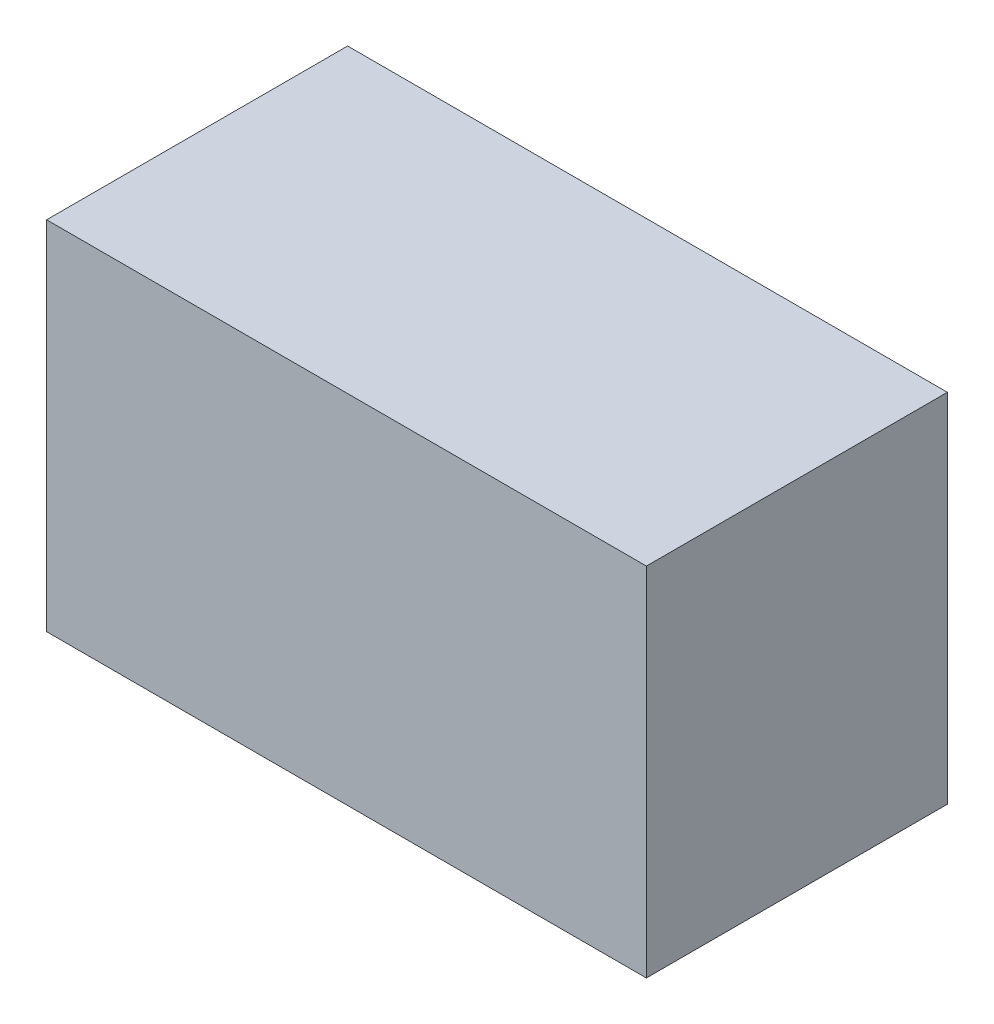
ISO-10303-21;
HEADER;
FILE_DESCRIPTION(('STEP AP214'),'2;1');
FILE_NAME('part.step','',(''),(''),'','','');
FILE_SCHEMA(('AUTOMOTIVE_DESIGN { 1 0 10303 214 1 1 1 1 }'));
ENDSEC;
DATA;
#1=APPLICATION_CONTEXT('core data for automotive mechanical design processes');
#2=APPLICATION_PROTOCOL_DEFINITION('international standard','automotive_design',2000,#1);
#3=PRODUCT_CONTEXT('',#1,'mechanical');
#4=PRODUCT('Part','Part','',(#3));
#5=PRODUCT_RELATED_PRODUCT_CATEGORY('part','',(#4));
#6=PRODUCT_DEFINITION_FORMATION('','',#4);
#7=PRODUCT_DEFINITION_CONTEXT('part definition',#1,'design');
#8=PRODUCT_DEFINITION('design','',#6,#7);
#9=PRODUCT_DEFINITION_SHAPE('','',#8);
#10=(LENGTH_UNIT() NAMED_UNIT(*) SI_UNIT(.MILLI.,.METRE.));
#11=(NAMED_UNIT(*) PLANE_ANGLE_UNIT() SI_UNIT($,.RADIAN.));
#12=(NAMED_UNIT(*) SI_UNIT($,.STERADIAN.) SOLID_ANGLE_UNIT());
#13=UNCERTAINTY_MEASURE_WITH_UNIT(LENGTH_MEASURE(1.E-05),#10,'distance_accuracy_value','');
#14=(GEOMETRIC_REPRESENTATION_CONTEXT(3) GLOBAL_UNCERTAINTY_ASSIGNED_CONTEXT((#13)) GLOBAL_UNIT_ASSIGNED_CONTEXT((#10,
#11,#12)) REPRESENTATION_CONTEXT('',''));
#15=CARTESIAN_POINT('',(0.,0.,0.));
#16=DIRECTION('',(0.,0.,1.));
#17=DIRECTION('',(1.,0.,0.));
#18=AXIS2_PLACEMENT_3D('',#15,#16,#17);
#19=CARTESIAN_POINT('',(-1.34500336123163,0.80001339826083,0.));
#20=DIRECTION('',(-1.,4.37113882867379E-08,0.));
#21=DIRECTION('',(-4.37113882867379E-08,-1.,0.));
#22=AXIS2_PLACEMENT_3D('',#19,#20,#21);
#23=PLANE('',#22);
#24=DIRECTION('',(-4.37113883242782E-08,-0.999999999999999,0.));
#25=VECTOR('',#24,1.);
#26=CARTESIAN_POINT('',(-1.34500336123163,0.80001339826083,0.));
#27=LINE('',#26,#25);
#28=CARTESIAN_POINT('',(-1.34500336123163,0.80001339826083,0.));
#29=VERTEX_POINT('',#28);
#30=CARTESIAN_POINT('',(-1.34500343117013,-0.799992705254795,0.));
#31=VERTEX_POINT('',#30);
#32=EDGE_CURVE('E11',#29,#31,#27,.T.);
#33=ORIENTED_EDGE('',*,*,#32,.T.);
#34=DIRECTION('',(0.,0.,1.));
#35=VECTOR('',#34,1.);
#36=CARTESIAN_POINT('',(-1.34500343117012,-0.799992705254795,0.));
#37=LINE('',#36,#35);
#38=CARTESIAN_POINT('',(-1.34500343117013,-0.799992705254795,1.34999978542328));
#39=VERTEX_POINT('',#38);
#40=EDGE_CURVE('E88',#31,#39,#37,.T.);
#41=ORIENTED_EDGE('',*,*,#40,.T.);
#42=DIRECTION('',(-4.37113883242782E-08,-0.999999999999999,0.));
#43=VECTOR('',#42,1.);
#44=CARTESIAN_POINT('',(-1.34500336123163,0.80001339826083,1.34999978542328));
#45=LINE('',#44,#43);
#46=CARTESIAN_POINT('',(-1.34500336123163,0.80001339826083,1.34999978542328));
#47=VERTEX_POINT('',#46);
#48=EDGE_CURVE('E83',#47,#39,#45,.T.);
#49=ORIENTED_EDGE('',*,*,#48,.F.);
#50=DIRECTION('',(0.,0.,1.));
#51=VECTOR('',#50,1.);
#52=CARTESIAN_POINT('',(-1.34500336123163,0.800013398260833,0.));
#53=LINE('',#52,#51);
#54=EDGE_CURVE('E72',#29,#47,#53,.T.);
#55=ORIENTED_EDGE('',*,*,#54,.F.);
#56=EDGE_LOOP('',(#33,#41,#49,#55));
#57=FACE_BOUND('',#56,.T.);
#58=ADVANCED_FACE('F17',(#57),#23,.T.);
#59=CARTESIAN_POINT('',(-1.34500343117013,-0.799992705254795,0.));
#60=DIRECTION('',(-4.37113882867379E-08,-1.,0.));
#61=DIRECTION('',(1.,-4.37113882867379E-08,0.));
#62=AXIS2_PLACEMENT_3D('',#59,#60,#61);
#63=PLANE('',#62);
#64=DIRECTION('',(0.999999999999999,-4.37113882791606E-08,0.));
#65=VECTOR('',#64,1.);
#66=CARTESIAN_POINT('',(-1.34500343117013,-0.799992705254795,0.));
#67=LINE('',#66,#65);
#68=CARTESIAN_POINT('',(1.34499901023612,-0.799992822838533,0.));
#69=VERTEX_POINT('',#68);
#70=EDGE_CURVE('E24',#31,#69,#67,.T.);
#71=ORIENTED_EDGE('',*,*,#70,.T.);
#72=DIRECTION('',(0.,0.,1.));
#73=VECTOR('',#72,1.);
#74=CARTESIAN_POINT('',(1.34499901023612,-0.799992822838536,0.));
#75=LINE('',#74,#73);
#76=CARTESIAN_POINT('',(1.34499901023612,-0.799992822838533,1.34999978542328));
#77=VERTEX_POINT('',#76);
#78=EDGE_CURVE('E85',#69,#77,#75,.T.);
#79=ORIENTED_EDGE('',*,*,#78,.T.);
#80=DIRECTION('',(0.999999999999999,-4.37113882791606E-08,0.));
#81=VECTOR('',#80,1.);
#82=CARTESIAN_POINT('',(-1.34500343117013,-0.799992705254795,1.34999978542328));
#83=LINE('',#82,#81);
#84=EDGE_CURVE('E66',#39,#77,#83,.T.);
#85=ORIENTED_EDGE('',*,*,#84,.F.);
#86=ORIENTED_EDGE('',*,*,#40,.F.);
#87=EDGE_LOOP('',(#71,#79,#85,#86));
#88=FACE_BOUND('',#87,.T.);
#89=ADVANCED_FACE('F89',(#88),#63,.T.);
#90=CARTESIAN_POINT('',(1.34499901023612,-0.799992822838533,0.));
#91=DIRECTION('',(1.,-4.37113882867379E-08,0.));
#92=DIRECTION('',(4.37113882867379E-08,1.,0.));
#93=AXIS2_PLACEMENT_3D('',#90,#91,#92);
#94=PLANE('',#93);
#95=DIRECTION('',(4.37113883242782E-08,0.999999999999999,0.));
#96=VECTOR('',#95,1.);
#97=CARTESIAN_POINT('',(1.34499901023612,-0.799992822838533,0.));
#98=LINE('',#97,#96);
#99=CARTESIAN_POINT('',(1.34499908017462,0.800013280677092,0.));
#100=VERTEX_POINT('',#99);
#101=EDGE_CURVE('E62',#69,#100,#98,.T.);
#102=ORIENTED_EDGE('',*,*,#101,.T.);
#103=DIRECTION('',(0.,0.,1.));
#104=VECTOR('',#103,1.);
#105=CARTESIAN_POINT('',(1.34499908017461,0.800013280677092,0.));
#106=LINE('',#105,#104);
#107=CARTESIAN_POINT('',(1.34499908017462,0.800013280677092,1.34999978542328));
#108=VERTEX_POINT('',#107);
#109=EDGE_CURVE('E55',#100,#108,#106,.T.);
#110=ORIENTED_EDGE('',*,*,#109,.T.);
#111=DIRECTION('',(4.37113883242782E-08,0.999999999999999,0.));
#112=VECTOR('',#111,1.);
#113=CARTESIAN_POINT('',(1.34499901023612,-0.799992822838533,1.34999978542328));
#114=LINE('',#113,#112);
#115=EDGE_CURVE('E59',#77,#108,#114,.T.);
#116=ORIENTED_EDGE('',*,*,#115,.F.);
#117=ORIENTED_EDGE('',*,*,#78,.F.);
#118=EDGE_LOOP('',(#102,#110,#116,#117));
#119=FACE_BOUND('',#118,.T.);
#120=ADVANCED_FACE('F57',(#119),#94,.T.);
#121=CARTESIAN_POINT('',(1.34499908017462,0.800013280677092,0.));
#122=DIRECTION('',(4.37113882867379E-08,1.,0.));
#123=DIRECTION('',(-1.,4.37113882867379E-08,0.));
#124=AXIS2_PLACEMENT_3D('',#121,#122,#123);
#125=PLANE('',#124);
#126=DIRECTION('',(-0.999999999999999,4.37113882791606E-08,0.));
#127=VECTOR('',#126,1.);
#128=CARTESIAN_POINT('',(1.34499908017462,0.800013280677092,0.));
#129=LINE('',#128,#127);
#130=EDGE_CURVE('E65',#100,#29,#129,.T.);
#131=ORIENTED_EDGE('',*,*,#130,.T.);
#132=ORIENTED_EDGE('',*,*,#54,.T.);
#133=DIRECTION('',(-0.999999999999999,4.37113882791606E-08,0.));
#134=VECTOR('',#133,1.);
#135=CARTESIAN_POINT('',(1.34499908017462,0.800013280677092,1.34999978542328));
#136=LINE('',#135,#134);
#137=EDGE_CURVE('E70',#108,#47,#136,.T.);
#138=ORIENTED_EDGE('',*,*,#137,.F.);
#139=ORIENTED_EDGE('',*,*,#109,.F.);
#140=EDGE_LOOP('',(#131,#132,#138,#139));
#141=FACE_BOUND('',#140,.T.);
#142=ADVANCED_FACE('F71',(#141),#125,.T.);
#143=CARTESIAN_POINT('',(-113.724990844727,398.850006103516,1.34999978542328));
#144=DIRECTION('',(0.,0.,1.));
#145=DIRECTION('',(-4.37113882867379E-08,-1.,0.));
#146=AXIS2_PLACEMENT_3D('',#143,#144,#145);
#147=PLANE('',#146);
#148=ORIENTED_EDGE('',*,*,#48,.T.);
#149=ORIENTED_EDGE('',*,*,#84,.T.);
#150=ORIENTED_EDGE('',*,*,#115,.T.);
#151=ORIENTED_EDGE('',*,*,#137,.T.);
#152=EDGE_LOOP('',(#148,#149,#150,#151));
#153=FACE_BOUND('',#152,.T.);
#154=ADVANCED_FACE('F76',(#153),#147,.T.);
#155=CARTESIAN_POINT('',(-113.724990844727,398.850006103516,0.));
#156=DIRECTION('',(0.,0.,1.));
#157=DIRECTION('',(-4.37113882867379E-08,-1.,0.));
#158=AXIS2_PLACEMENT_3D('',#155,#156,#157);
#159=PLANE('',#158);
#160=ORIENTED_EDGE('',*,*,#130,.F.);
#161=ORIENTED_EDGE('',*,*,#101,.F.);
#162=ORIENTED_EDGE('',*,*,#70,.F.);
#163=ORIENTED_EDGE('',*,*,#32,.F.);
#164=EDGE_LOOP('',(#160,#161,#162,#163));
#165=FACE_BOUND('',#164,.T.);
#166=ADVANCED_FACE('F91',(#165),#159,.F.);
#167=CLOSED_SHELL('',(#58,#89,#120,#142,#154,#166));
#168=MANIFOLD_SOLID_BREP('B1',#167);
#169=ADVANCED_BREP_SHAPE_REPRESENTATION('',(#18,#168),#14);
#170=SHAPE_DEFINITION_REPRESENTATION(#9,#169);
ENDSEC;
END-ISO-10303-21;
